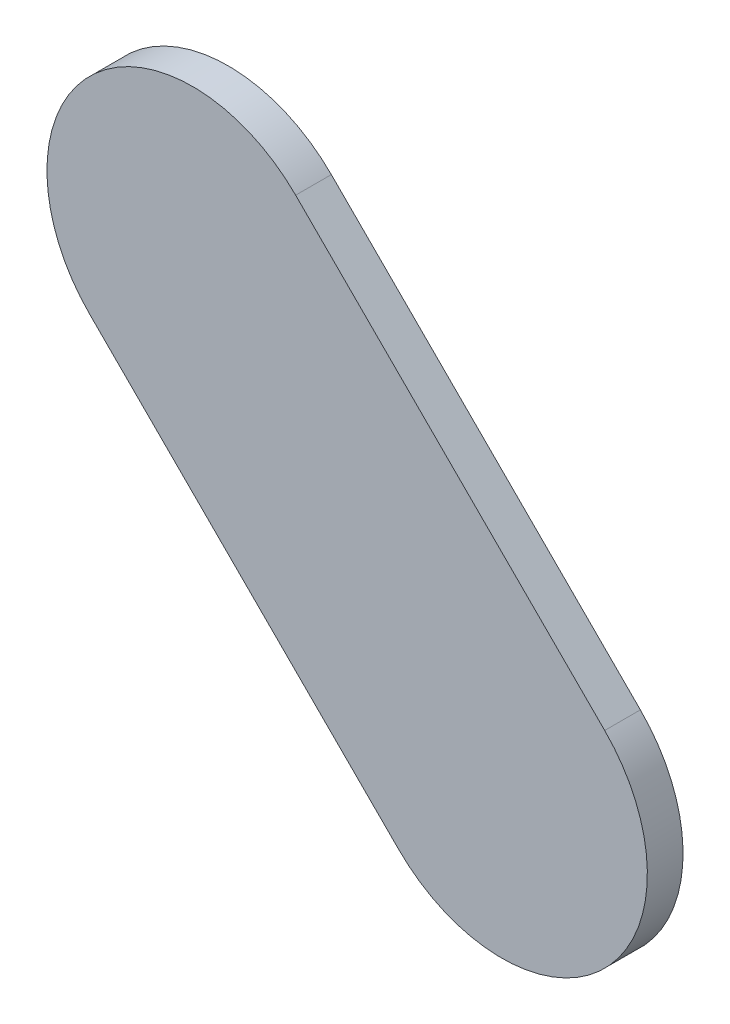
ISO-10303-21;
HEADER;
FILE_DESCRIPTION(('STEP AP214'),'2;1');
FILE_NAME('part.step','',(''),(''),'','','');
FILE_SCHEMA(('AUTOMOTIVE_DESIGN { 1 0 10303 214 1 1 1 1 }'));
ENDSEC;
DATA;
#1=APPLICATION_CONTEXT('core data for automotive mechanical design processes');
#2=APPLICATION_PROTOCOL_DEFINITION('international standard','automotive_design',2000,#1);
#3=PRODUCT_CONTEXT('',#1,'mechanical');
#4=PRODUCT('Part','Part','',(#3));
#5=PRODUCT_RELATED_PRODUCT_CATEGORY('part','',(#4));
#6=PRODUCT_DEFINITION_FORMATION('','',#4);
#7=PRODUCT_DEFINITION_CONTEXT('part definition',#1,'design');
#8=PRODUCT_DEFINITION('design','',#6,#7);
#9=PRODUCT_DEFINITION_SHAPE('','',#8);
#10=(LENGTH_UNIT() NAMED_UNIT(*) SI_UNIT(.MILLI.,.METRE.));
#11=(NAMED_UNIT(*) PLANE_ANGLE_UNIT() SI_UNIT($,.RADIAN.));
#12=(NAMED_UNIT(*) SI_UNIT($,.STERADIAN.) SOLID_ANGLE_UNIT());
#13=UNCERTAINTY_MEASURE_WITH_UNIT(LENGTH_MEASURE(1.E-05),#10,'distance_accuracy_value','');
#14=(GEOMETRIC_REPRESENTATION_CONTEXT(3) GLOBAL_UNCERTAINTY_ASSIGNED_CONTEXT((#13)) GLOBAL_UNIT_ASSIGNED_CONTEXT((#10,
#11,#12)) REPRESENTATION_CONTEXT('',''));
#15=CARTESIAN_POINT('',(0.,0.,0.));
#16=DIRECTION('',(0.,0.,1.));
#17=DIRECTION('',(1.,0.,0.));
#18=AXIS2_PLACEMENT_3D('',#15,#16,#17);
#19=CARTESIAN_POINT('',(3.372375666303,6.617930705288,0.79916));
#20=DIRECTION('',(0.,0.,1.));
#21=DIRECTION('',(1.,0.,0.));
#22=AXIS2_PLACEMENT_3D('',#19,#20,#21);
#23=PLANE('',#22);
#24=CARTESIAN_POINT('',(3.223989667,6.765797101268,0.79916));
#25=DIRECTION('',(0.,0.,1.));
#26=DIRECTION('',(1.,0.,0.));
#27=AXIS2_PLACEMENT_3D('',#24,#25,#26);
#28=CIRCLE('',#27,0.140000470934);
#29=CARTESIAN_POINT('',(3.12499455583344,6.66680211116638,0.79916));
#30=VERTEX_POINT('',#29);
#31=CARTESIAN_POINT('',(3.32298503026737,6.86479230273356,0.79916));
#32=VERTEX_POINT('',#31);
#33=EDGE_CURVE('E20',#30,#32,#28,.F.);
#34=ORIENTED_EDGE('',*,*,#33,.F.);
#35=DIRECTION('',(-0.707107575236102,0.707105987136102,0.));
#36=VECTOR('',#35,1.);
#37=CARTESIAN_POINT('',(3.421979667001,6.369817667001,0.79916));
#38=LINE('',#37,#36);
#39=CARTESIAN_POINT('',(3.42197974790159,6.36981758610059,0.79916));
#40=VERTEX_POINT('',#39);
#41=EDGE_CURVE('E65',#30,#40,#38,.F.);
#42=ORIENTED_EDGE('',*,*,#41,.T.);
#43=CARTESIAN_POINT('',(3.520974667,6.468812,0.79916));
#44=DIRECTION('',(0.,0.,1.));
#45=DIRECTION('',(1.,0.,0.));
#46=AXIS2_PLACEMENT_3D('',#43,#44,#45);
#47=CIRCLE('',#46,0.140000070901);
#48=CARTESIAN_POINT('',(3.61996955533327,6.56780711066628,0.79916));
#49=VERTEX_POINT('',#48);
#50=EDGE_CURVE('E57',#49,#40,#47,.F.);
#51=ORIENTED_EDGE('',*,*,#50,.F.);
#52=DIRECTION('',(0.707105987136602,-0.707107575235602,0.));
#53=VECTOR('',#52,1.);
#54=CARTESIAN_POINT('',(3.322985000001,6.864792333,0.79916));
#55=LINE('',#54,#53);
#56=EDGE_CURVE('E64',#49,#32,#55,.F.);
#57=ORIENTED_EDGE('',*,*,#56,.T.);
#58=EDGE_LOOP('',(#34,#42,#51,#57));
#59=FACE_BOUND('',#58,.T.);
#60=ADVANCED_FACE('F17',(#59),#23,.T.);
#61=CARTESIAN_POINT('',(3.421979667001,6.369817667001,0.76487));
#62=DIRECTION('',(0.707105987136102,0.707107575236102,0.));
#63=DIRECTION('',(-0.707107575236102,0.707105987136102,0.));
#64=AXIS2_PLACEMENT_3D('',#61,#62,#63);
#65=PLANE('',#64);
#66=DIRECTION('',(0.,0.,1.));
#67=VECTOR('',#66,1.);
#68=CARTESIAN_POINT('',(3.12499466699987,6.66680199999987,0.76487));
#69=LINE('',#68,#67);
#70=CARTESIAN_POINT('',(3.12499455583337,6.66680211116625,0.76487));
#71=VERTEX_POINT('',#70);
#72=EDGE_CURVE('E68',#71,#30,#69,.T.);
#73=ORIENTED_EDGE('',*,*,#72,.F.);
#74=DIRECTION('',(-0.707107575236587,0.707105987135616,0.));
#75=VECTOR('',#74,1.);
#76=CARTESIAN_POINT('',(3.421979667001,6.369817667001,0.76487));
#77=LINE('',#76,#75);
#78=CARTESIAN_POINT('',(3.42197974790162,6.36981758610056,0.76487));
#79=VERTEX_POINT('',#78);
#80=EDGE_CURVE('E72',#79,#71,#77,.T.);
#81=ORIENTED_EDGE('',*,*,#80,.F.);
#82=DIRECTION('',(0.,0.,1.));
#83=VECTOR('',#82,1.);
#84=CARTESIAN_POINT('',(3.421979667001,6.369817667001,0.76487));
#85=LINE('',#84,#83);
#86=EDGE_CURVE('E60',#40,#79,#85,.F.);
#87=ORIENTED_EDGE('',*,*,#86,.F.);
#88=ORIENTED_EDGE('',*,*,#41,.F.);
#89=EDGE_LOOP('',(#73,#81,#87,#88));
#90=FACE_BOUND('',#89,.T.);
#91=ADVANCED_FACE('F70',(#90),#65,.F.);
#92=CARTESIAN_POINT('',(3.223989667,6.765797101268,0.76487));
#93=DIRECTION('',(0.,0.,1.));
#94=DIRECTION('',(1.,0.,0.));
#95=AXIS2_PLACEMENT_3D('',#92,#93,#94);
#96=CYLINDRICAL_SURFACE('',#95,0.140000470934);
#97=DIRECTION('',(0.,0.,1.));
#98=VECTOR('',#97,1.);
#99=CARTESIAN_POINT('',(3.322985000001,6.864792333,0.76487));
#100=LINE('',#99,#98);
#101=CARTESIAN_POINT('',(3.32298503026735,6.86479230273358,0.76487));
#102=VERTEX_POINT('',#101);
#103=EDGE_CURVE('E77',#32,#102,#100,.F.);
#104=ORIENTED_EDGE('',*,*,#103,.T.);
#105=CARTESIAN_POINT('',(3.223989333,6.765797333,0.76487));
#106=DIRECTION('',(0.,0.,1.));
#107=DIRECTION('',(1.,0.,0.));
#108=AXIS2_PLACEMENT_3D('',#105,#106,#107);
#109=CIRCLE('',#108,0.140000070901);
#110=EDGE_CURVE('E26',#71,#102,#109,.F.);
#111=ORIENTED_EDGE('',*,*,#110,.F.);
#112=ORIENTED_EDGE('',*,*,#72,.T.);
#113=ORIENTED_EDGE('',*,*,#33,.T.);
#114=EDGE_LOOP('',(#104,#111,#112,#113));
#115=FACE_BOUND('',#114,.T.);
#116=ADVANCED_FACE('F88',(#115),#96,.T.);
#117=CARTESIAN_POINT('',(3.322985000001,6.864792333,0.76487));
#118=DIRECTION('',(-0.707107575235602,-0.707105987136602,0.));
#119=DIRECTION('',(0.707105987136602,-0.707107575235602,0.));
#120=AXIS2_PLACEMENT_3D('',#117,#118,#119);
#121=PLANE('',#120);
#122=DIRECTION('',(0.,0.,1.));
#123=VECTOR('',#122,1.);
#124=CARTESIAN_POINT('',(3.61996933300013,6.56780733300013,0.76487));
#125=LINE('',#124,#123);
#126=CARTESIAN_POINT('',(3.61996955533326,6.5678071106663,0.76487));
#127=VERTEX_POINT('',#126);
#128=EDGE_CURVE('E62',#127,#49,#125,.T.);
#129=ORIENTED_EDGE('',*,*,#128,.F.);
#130=DIRECTION('',(0.707105987136807,-0.707107575235397,0.));
#131=VECTOR('',#130,1.);
#132=CARTESIAN_POINT('',(3.322985000001,6.864792333,0.76487));
#133=LINE('',#132,#131);
#134=EDGE_CURVE('E11',#102,#127,#133,.T.);
#135=ORIENTED_EDGE('',*,*,#134,.F.);
#136=ORIENTED_EDGE('',*,*,#103,.F.);
#137=ORIENTED_EDGE('',*,*,#56,.F.);
#138=EDGE_LOOP('',(#129,#135,#136,#137));
#139=FACE_BOUND('',#138,.T.);
#140=ADVANCED_FACE('F96',(#139),#121,.F.);
#141=CARTESIAN_POINT('',(3.520974667,6.468812,0.76487));
#142=DIRECTION('',(0.,0.,1.));
#143=DIRECTION('',(1.,0.,0.));
#144=AXIS2_PLACEMENT_3D('',#141,#142,#143);
#145=CYLINDRICAL_SURFACE('',#144,0.140000070901);
#146=CARTESIAN_POINT('',(3.520974667001,6.468812565733,0.76487));
#147=DIRECTION('',(0.,0.,1.));
#148=DIRECTION('',(1.,0.,0.));
#149=AXIS2_PLACEMENT_3D('',#146,#147,#148);
#150=CIRCLE('',#149,0.14);
#151=EDGE_CURVE('E35',#127,#79,#150,.F.);
#152=ORIENTED_EDGE('',*,*,#151,.F.);
#153=ORIENTED_EDGE('',*,*,#128,.T.);
#154=ORIENTED_EDGE('',*,*,#50,.T.);
#155=ORIENTED_EDGE('',*,*,#86,.T.);
#156=EDGE_LOOP('',(#152,#153,#154,#155));
#157=FACE_BOUND('',#156,.T.);
#158=ADVANCED_FACE('F58',(#157),#145,.T.);
#159=CARTESIAN_POINT('',(3.372375666303,6.617930705288,0.76487));
#160=DIRECTION('',(0.,0.,-1.));
#161=DIRECTION('',(-1.,0.,0.));
#162=AXIS2_PLACEMENT_3D('',#159,#160,#161);
#163=PLANE('',#162);
#164=ORIENTED_EDGE('',*,*,#134,.T.);
#165=ORIENTED_EDGE('',*,*,#151,.T.);
#166=ORIENTED_EDGE('',*,*,#80,.T.);
#167=ORIENTED_EDGE('',*,*,#110,.T.);
#168=EDGE_LOOP('',(#164,#165,#166,#167));
#169=FACE_BOUND('',#168,.T.);
#170=ADVANCED_FACE('F89',(#169),#163,.T.);
#171=CLOSED_SHELL('',(#60,#91,#116,#140,#158,#170));
#172=MANIFOLD_SOLID_BREP('B1',#171);
#173=ADVANCED_BREP_SHAPE_REPRESENTATION('',(#18,#172),#14);
#174=SHAPE_DEFINITION_REPRESENTATION(#9,#173);
ENDSEC;
END-ISO-10303-21;
